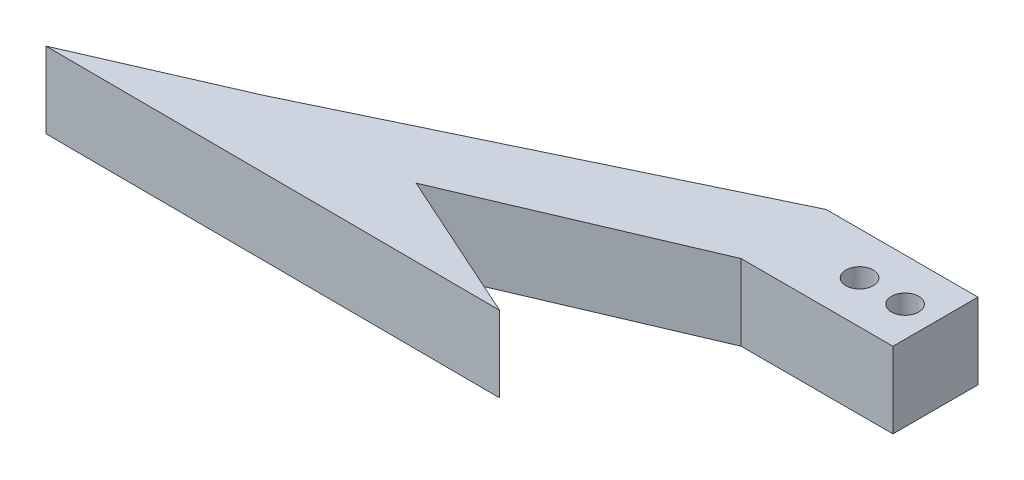
ISO-10303-21;
HEADER;
FILE_DESCRIPTION(('STEP AP214'),'2;1');
FILE_NAME('part.step','',(''),(''),'','','');
FILE_SCHEMA(('AUTOMOTIVE_DESIGN { 1 0 10303 214 1 1 1 1 }'));
ENDSEC;
DATA;
#1=APPLICATION_CONTEXT('core data for automotive mechanical design processes');
#2=APPLICATION_PROTOCOL_DEFINITION('international standard','automotive_design',2000,#1);
#3=PRODUCT_CONTEXT('',#1,'mechanical');
#4=PRODUCT('Part','Part','',(#3));
#5=PRODUCT_RELATED_PRODUCT_CATEGORY('part','',(#4));
#6=PRODUCT_DEFINITION_FORMATION('','',#4);
#7=PRODUCT_DEFINITION_CONTEXT('part definition',#1,'design');
#8=PRODUCT_DEFINITION('design','',#6,#7);
#9=PRODUCT_DEFINITION_SHAPE('','',#8);
#10=(LENGTH_UNIT() NAMED_UNIT(*) SI_UNIT(.MILLI.,.METRE.));
#11=(NAMED_UNIT(*) PLANE_ANGLE_UNIT() SI_UNIT($,.RADIAN.));
#12=(NAMED_UNIT(*) SI_UNIT($,.STERADIAN.) SOLID_ANGLE_UNIT());
#13=UNCERTAINTY_MEASURE_WITH_UNIT(LENGTH_MEASURE(1.E-05),#10,'distance_accuracy_value','');
#14=(GEOMETRIC_REPRESENTATION_CONTEXT(3) GLOBAL_UNCERTAINTY_ASSIGNED_CONTEXT((#13)) GLOBAL_UNIT_ASSIGNED_CONTEXT((#10,
#11,#12)) REPRESENTATION_CONTEXT('',''));
#15=CARTESIAN_POINT('',(0.,0.,0.));
#16=DIRECTION('',(0.,0.,1.));
#17=DIRECTION('',(1.,0.,0.));
#18=AXIS2_PLACEMENT_3D('',#15,#16,#17);
#19=CARTESIAN_POINT('',(-0.672341705519628,6.35,-1.57580087231163));
#20=DIRECTION('',(0.392438685047784,0.,0.919778168080742));
#21=DIRECTION('',(0.919778168080743,0.,-0.392438685047784));
#22=AXIS2_PLACEMENT_3D('',#19,#20,#21);
#23=PLANE('',#22);
#24=DIRECTION('',(-0.919778168080743,0.,0.392438685047784));
#25=VECTOR('',#24,1.);
#26=CARTESIAN_POINT('',(-0.672341705519628,0.,-1.57580087231163));
#27=LINE('',#26,#25);
#28=CARTESIAN_POINT('',(-12.7,0.,3.556));
#29=VERTEX_POINT('',#28);
#30=CARTESIAN_POINT('',(-31.75,0.,11.684));
#31=VERTEX_POINT('',#30);
#32=EDGE_CURVE('E138',#29,#31,#27,.T.);
#33=ORIENTED_EDGE('',*,*,#32,.F.);
#34=DIRECTION('',(0.,-1.,0.));
#35=VECTOR('',#34,1.);
#36=CARTESIAN_POINT('',(-12.7,6.35,3.556));
#37=LINE('',#36,#35);
#38=CARTESIAN_POINT('',(-12.7,6.35,3.556));
#39=VERTEX_POINT('',#38);
#40=EDGE_CURVE('E11',#39,#29,#37,.T.);
#41=ORIENTED_EDGE('',*,*,#40,.F.);
#42=DIRECTION('',(-0.919778168080743,0.,0.392438685047784));
#43=VECTOR('',#42,1.);
#44=CARTESIAN_POINT('',(-0.672341705519628,6.35,-1.57580087231163));
#45=LINE('',#44,#43);
#46=CARTESIAN_POINT('',(-31.75,6.35,11.684));
#47=VERTEX_POINT('',#46);
#48=EDGE_CURVE('E58',#39,#47,#45,.T.);
#49=ORIENTED_EDGE('',*,*,#48,.T.);
#50=DIRECTION('',(0.,-1.,0.));
#51=VECTOR('',#50,1.);
#52=CARTESIAN_POINT('',(-31.75,6.35,11.684));
#53=LINE('',#52,#51);
#54=EDGE_CURVE('E84',#47,#31,#53,.T.);
#55=ORIENTED_EDGE('',*,*,#54,.T.);
#56=EDGE_LOOP('',(#33,#41,#49,#55));
#57=FACE_BOUND('',#56,.T.);
#58=ADVANCED_FACE('F41',(#57),#23,.T.);
#59=CARTESIAN_POINT('',(0.,6.35,3.556));
#60=DIRECTION('',(0.,0.,1.));
#61=DIRECTION('',(1.,0.,0.));
#62=AXIS2_PLACEMENT_3D('',#59,#60,#61);
#63=PLANE('',#62);
#64=DIRECTION('',(-1.,0.,0.));
#65=VECTOR('',#64,1.);
#66=CARTESIAN_POINT('',(0.,0.,3.556));
#67=LINE('',#66,#65);
#68=CARTESIAN_POINT('',(0.,0.,3.556));
#69=VERTEX_POINT('',#68);
#70=EDGE_CURVE('E141',#69,#29,#67,.T.);
#71=ORIENTED_EDGE('',*,*,#70,.F.);
#72=DIRECTION('',(0.,-1.,0.));
#73=VECTOR('',#72,1.);
#74=CARTESIAN_POINT('',(0.,6.35,3.556));
#75=LINE('',#74,#73);
#76=CARTESIAN_POINT('',(0.,6.35,3.556));
#77=VERTEX_POINT('',#76);
#78=EDGE_CURVE('E50',#77,#69,#75,.T.);
#79=ORIENTED_EDGE('',*,*,#78,.F.);
#80=DIRECTION('',(-1.,0.,0.));
#81=VECTOR('',#80,1.);
#82=CARTESIAN_POINT('',(0.,6.35,3.556));
#83=LINE('',#82,#81);
#84=EDGE_CURVE('E127',#77,#39,#83,.T.);
#85=ORIENTED_EDGE('',*,*,#84,.T.);
#86=ORIENTED_EDGE('',*,*,#40,.T.);
#87=EDGE_LOOP('',(#71,#79,#85,#86));
#88=FACE_BOUND('',#87,.T.);
#89=ADVANCED_FACE('F175',(#88),#63,.T.);
#90=CARTESIAN_POINT('',(0.,6.35,0.));
#91=DIRECTION('',(1.,0.,0.));
#92=DIRECTION('',(0.,0.,-1.));
#93=AXIS2_PLACEMENT_3D('',#90,#91,#92);
#94=PLANE('',#93);
#95=DIRECTION('',(0.,0.,1.));
#96=VECTOR('',#95,1.);
#97=CARTESIAN_POINT('',(0.,0.,0.));
#98=LINE('',#97,#96);
#99=CARTESIAN_POINT('',(0.,0.,-3.556));
#100=VERTEX_POINT('',#99);
#101=EDGE_CURVE('E146',#100,#69,#98,.T.);
#102=ORIENTED_EDGE('',*,*,#101,.F.);
#103=DIRECTION('',(0.,-1.,0.));
#104=VECTOR('',#103,1.);
#105=CARTESIAN_POINT('',(0.,6.35,-3.556));
#106=LINE('',#105,#104);
#107=CARTESIAN_POINT('',(0.,6.35,-3.556));
#108=VERTEX_POINT('',#107);
#109=EDGE_CURVE('E105',#108,#100,#106,.T.);
#110=ORIENTED_EDGE('',*,*,#109,.F.);
#111=DIRECTION('',(0.,0.,1.));
#112=VECTOR('',#111,1.);
#113=CARTESIAN_POINT('',(0.,6.35,0.));
#114=LINE('',#113,#112);
#115=EDGE_CURVE('E123',#108,#77,#114,.T.);
#116=ORIENTED_EDGE('',*,*,#115,.T.);
#117=ORIENTED_EDGE('',*,*,#78,.T.);
#118=EDGE_LOOP('',(#102,#110,#116,#117));
#119=FACE_BOUND('',#118,.T.);
#120=ADVANCED_FACE('F172',(#119),#94,.T.);
#121=CARTESIAN_POINT('',(0.,6.35,-3.556));
#122=DIRECTION('',(0.,0.,-1.));
#123=DIRECTION('',(-1.,0.,0.));
#124=AXIS2_PLACEMENT_3D('',#121,#122,#123);
#125=PLANE('',#124);
#126=DIRECTION('',(1.,0.,0.));
#127=VECTOR('',#126,1.);
#128=CARTESIAN_POINT('',(0.,0.,-3.556));
#129=LINE('',#128,#127);
#130=CARTESIAN_POINT('',(-12.7,0.,-3.556));
#131=VERTEX_POINT('',#130);
#132=EDGE_CURVE('E103',#131,#100,#129,.T.);
#133=ORIENTED_EDGE('',*,*,#132,.F.);
#134=DIRECTION('',(0.,-1.,0.));
#135=VECTOR('',#134,1.);
#136=CARTESIAN_POINT('',(-12.7,6.35,-3.556));
#137=LINE('',#136,#135);
#138=CARTESIAN_POINT('',(-12.7,6.35,-3.556));
#139=VERTEX_POINT('',#138);
#140=EDGE_CURVE('E79',#139,#131,#137,.T.);
#141=ORIENTED_EDGE('',*,*,#140,.F.);
#142=DIRECTION('',(1.,0.,0.));
#143=VECTOR('',#142,1.);
#144=CARTESIAN_POINT('',(0.,6.35,-3.556));
#145=LINE('',#144,#143);
#146=EDGE_CURVE('E101',#139,#108,#145,.T.);
#147=ORIENTED_EDGE('',*,*,#146,.T.);
#148=ORIENTED_EDGE('',*,*,#109,.T.);
#149=EDGE_LOOP('',(#133,#141,#147,#148));
#150=FACE_BOUND('',#149,.T.);
#151=ADVANCED_FACE('F99',(#150),#125,.T.);
#152=CARTESIAN_POINT('',(-3.76540962288687,6.35,-7.84460338101431));
#153=DIRECTION('',(0.432731067584771,0.,0.901523057468274));
#154=DIRECTION('',(0.901523057468274,0.,-0.432731067584771));
#155=AXIS2_PLACEMENT_3D('',#152,#153,#154);
#156=PLANE('',#155);
#157=DIRECTION('',(-0.901523057468274,0.,0.432731067584771));
#158=VECTOR('',#157,1.);
#159=CARTESIAN_POINT('',(-3.76540962288687,0.,-7.84460338101431));
#160=LINE('',#159,#158);
#161=CARTESIAN_POINT('',(-44.45,0.,11.684));
#162=VERTEX_POINT('',#161);
#163=EDGE_CURVE('E152',#131,#162,#160,.T.);
#164=ORIENTED_EDGE('',*,*,#163,.T.);
#165=DIRECTION('',(0.,-1.,0.));
#166=VECTOR('',#165,1.);
#167=CARTESIAN_POINT('',(-44.45,6.35,11.684));
#168=LINE('',#167,#166);
#169=CARTESIAN_POINT('',(-44.45,6.35,11.684));
#170=VERTEX_POINT('',#169);
#171=EDGE_CURVE('E106',#170,#162,#168,.T.);
#172=ORIENTED_EDGE('',*,*,#171,.F.);
#173=DIRECTION('',(-0.901523057468274,0.,0.432731067584771));
#174=VECTOR('',#173,1.);
#175=CARTESIAN_POINT('',(-3.76540962288687,6.35,-7.84460338101431));
#176=LINE('',#175,#174);
#177=EDGE_CURVE('E109',#139,#170,#176,.T.);
#178=ORIENTED_EDGE('',*,*,#177,.F.);
#179=ORIENTED_EDGE('',*,*,#140,.T.);
#180=EDGE_LOOP('',(#164,#172,#178,#179));
#181=FACE_BOUND('',#180,.T.);
#182=ADVANCED_FACE('F110',(#181),#156,.F.);
#183=CARTESIAN_POINT('',(-6.35,6.35,0.));
#184=DIRECTION('',(0.,-1.,0.));
#185=DIRECTION('',(0.,0.,-1.));
#186=AXIS2_PLACEMENT_3D('',#183,#184,#185);
#187=CYLINDRICAL_SURFACE('',#186,1.143);
#188=CARTESIAN_POINT('',(-6.35,6.35,0.));
#189=DIRECTION('',(0.,1.,0.));
#190=DIRECTION('',(0.,0.,1.));
#191=AXIS2_PLACEMENT_3D('',#188,#189,#190);
#192=CIRCLE('',#191,1.143);
#193=CARTESIAN_POINT('',(-6.35,6.35,1.143));
#194=VERTEX_POINT('',#193);
#195=EDGE_CURVE('E116',#194,#194,#192,.T.);
#196=ORIENTED_EDGE('',*,*,#195,.T.);
#197=EDGE_LOOP('',(#196));
#198=FACE_BOUND('',#197,.T.);
#199=CARTESIAN_POINT('',(-6.35,0.,0.));
#200=DIRECTION('',(0.,1.,0.));
#201=DIRECTION('',(0.,0.,1.));
#202=AXIS2_PLACEMENT_3D('',#199,#200,#201);
#203=CIRCLE('',#202,1.143);
#204=CARTESIAN_POINT('',(-6.35,0.,1.143));
#205=VERTEX_POINT('',#204);
#206=EDGE_CURVE('E155',#205,#205,#203,.T.);
#207=ORIENTED_EDGE('',*,*,#206,.F.);
#208=EDGE_LOOP('',(#207));
#209=FACE_BOUND('',#208,.T.);
#210=ADVANCED_FACE('F252',(#198,#209),#187,.F.);
#211=CARTESIAN_POINT('',(-2.54,6.35,0.));
#212=DIRECTION('',(0.,-1.,0.));
#213=DIRECTION('',(0.,0.,-1.));
#214=AXIS2_PLACEMENT_3D('',#211,#212,#213);
#215=CYLINDRICAL_SURFACE('',#214,1.143);
#216=CARTESIAN_POINT('',(-2.54,6.35,0.));
#217=DIRECTION('',(0.,1.,0.));
#218=DIRECTION('',(0.,0.,1.));
#219=AXIS2_PLACEMENT_3D('',#216,#217,#218);
#220=CIRCLE('',#219,1.143);
#221=CARTESIAN_POINT('',(-2.54,6.35,1.143));
#222=VERTEX_POINT('',#221);
#223=EDGE_CURVE('E134',#222,#222,#220,.T.);
#224=ORIENTED_EDGE('',*,*,#223,.T.);
#225=EDGE_LOOP('',(#224));
#226=FACE_BOUND('',#225,.T.);
#227=CARTESIAN_POINT('',(-2.54,0.,0.));
#228=DIRECTION('',(0.,1.,0.));
#229=DIRECTION('',(0.,0.,1.));
#230=AXIS2_PLACEMENT_3D('',#227,#228,#229);
#231=CIRCLE('',#230,1.143);
#232=CARTESIAN_POINT('',(-2.54,0.,1.143));
#233=VERTEX_POINT('',#232);
#234=EDGE_CURVE('E159',#233,#233,#231,.T.);
#235=ORIENTED_EDGE('',*,*,#234,.F.);
#236=EDGE_LOOP('',(#235));
#237=FACE_BOUND('',#236,.T.);
#238=ADVANCED_FACE('F255',(#226,#237),#215,.F.);
#239=CARTESIAN_POINT('',(0.,6.35,0.));
#240=DIRECTION('',(0.,1.,0.));
#241=DIRECTION('',(0.,0.,1.));
#242=AXIS2_PLACEMENT_3D('',#239,#240,#241);
#243=PLANE('',#242);
#244=ORIENTED_EDGE('',*,*,#48,.F.);
#245=ORIENTED_EDGE('',*,*,#84,.F.);
#246=ORIENTED_EDGE('',*,*,#115,.F.);
#247=ORIENTED_EDGE('',*,*,#146,.F.);
#248=ORIENTED_EDGE('',*,*,#177,.T.);
#249=DIRECTION('',(-0.916386556062429,0.,0.40029449142855));
#250=VECTOR('',#249,1.);
#251=CARTESIAN_POINT('',(-44.45,6.35,11.684));
#252=LINE('',#251,#250);
#253=CARTESIAN_POINT('',(-57.15,6.35,17.2315934336997));
#254=VERTEX_POINT('',#253);
#255=EDGE_CURVE('E190',#170,#254,#252,.T.);
#256=ORIENTED_EDGE('',*,*,#255,.T.);
#257=DIRECTION('',(0.999990480720735,0.,0.00436330928474624));
#258=VECTOR('',#257,1.);
#259=CARTESIAN_POINT('',(-57.15,6.35,17.2315934336997));
#260=LINE('',#259,#258);
#261=CARTESIAN_POINT('',(-19.05,6.35,17.3978370999684));
#262=VERTEX_POINT('',#261);
#263=EDGE_CURVE('E215',#254,#262,#260,.T.);
#264=ORIENTED_EDGE('',*,*,#263,.T.);
#265=DIRECTION('',(-0.911952751696882,0.,-0.410295233548338));
#266=VECTOR('',#265,1.);
#267=CARTESIAN_POINT('',(-19.05,6.35,17.3978370999684));
#268=LINE('',#267,#266);
#269=EDGE_CURVE('E209',#262,#47,#268,.T.);
#270=ORIENTED_EDGE('',*,*,#269,.T.);
#271=EDGE_LOOP('',(#244,#245,#246,#247,#248,#256,#264,#270));
#272=FACE_BOUND('',#271,.T.);
#273=ORIENTED_EDGE('',*,*,#195,.F.);
#274=EDGE_LOOP('',(#273));
#275=FACE_BOUND('',#274,.T.);
#276=ORIENTED_EDGE('',*,*,#223,.F.);
#277=EDGE_LOOP('',(#276));
#278=FACE_BOUND('',#277,.T.);
#279=ADVANCED_FACE('F119',(#272,#275,#278),#243,.T.);
#280=CARTESIAN_POINT('',(0.,0.,0.));
#281=DIRECTION('',(0.,1.,0.));
#282=DIRECTION('',(0.,0.,1.));
#283=AXIS2_PLACEMENT_3D('',#280,#281,#282);
#284=PLANE('',#283);
#285=ORIENTED_EDGE('',*,*,#32,.T.);
#286=DIRECTION('',(-0.911952751696882,0.,-0.410295233548338));
#287=VECTOR('',#286,1.);
#288=CARTESIAN_POINT('',(-19.05,0.,17.3978370999684));
#289=LINE('',#288,#287);
#290=CARTESIAN_POINT('',(-19.05,0.,17.3978370999684));
#291=VERTEX_POINT('',#290);
#292=EDGE_CURVE('E204',#291,#31,#289,.T.);
#293=ORIENTED_EDGE('',*,*,#292,.F.);
#294=DIRECTION('',(0.999990480720735,0.,0.00436330928474624));
#295=VECTOR('',#294,1.);
#296=CARTESIAN_POINT('',(-57.15,0.,17.2315934336997));
#297=LINE('',#296,#295);
#298=CARTESIAN_POINT('',(-57.15,0.,17.2315934336997));
#299=VERTEX_POINT('',#298);
#300=EDGE_CURVE('E196',#299,#291,#297,.T.);
#301=ORIENTED_EDGE('',*,*,#300,.F.);
#302=DIRECTION('',(-0.916386556062429,0.,0.40029449142855));
#303=VECTOR('',#302,1.);
#304=CARTESIAN_POINT('',(-44.45,0.,11.684));
#305=LINE('',#304,#303);
#306=EDGE_CURVE('E183',#162,#299,#305,.T.);
#307=ORIENTED_EDGE('',*,*,#306,.F.);
#308=ORIENTED_EDGE('',*,*,#163,.F.);
#309=ORIENTED_EDGE('',*,*,#132,.T.);
#310=ORIENTED_EDGE('',*,*,#101,.T.);
#311=ORIENTED_EDGE('',*,*,#70,.T.);
#312=EDGE_LOOP('',(#285,#293,#301,#307,#308,#309,#310,#311));
#313=FACE_BOUND('',#312,.T.);
#314=ORIENTED_EDGE('',*,*,#206,.T.);
#315=EDGE_LOOP('',(#314));
#316=FACE_BOUND('',#315,.T.);
#317=ORIENTED_EDGE('',*,*,#234,.T.);
#318=EDGE_LOOP('',(#317));
#319=FACE_BOUND('',#318,.T.);
#320=ADVANCED_FACE('F177',(#313,#316,#319),#284,.F.);
#321=CARTESIAN_POINT('',(-44.45,6.35,11.684));
#322=DIRECTION('',(0.40029449142855,0.,0.916386556062429));
#323=DIRECTION('',(0.916386556062429,0.,-0.40029449142855));
#324=AXIS2_PLACEMENT_3D('',#321,#322,#323);
#325=PLANE('',#324);
#326=ORIENTED_EDGE('',*,*,#306,.T.);
#327=DIRECTION('',(0.,-1.,0.));
#328=VECTOR('',#327,1.);
#329=CARTESIAN_POINT('',(-57.15,6.35,17.2315934336997));
#330=LINE('',#329,#328);
#331=EDGE_CURVE('E142',#254,#299,#330,.T.);
#332=ORIENTED_EDGE('',*,*,#331,.F.);
#333=ORIENTED_EDGE('',*,*,#255,.F.);
#334=ORIENTED_EDGE('',*,*,#171,.T.);
#335=EDGE_LOOP('',(#326,#332,#333,#334));
#336=FACE_BOUND('',#335,.T.);
#337=ADVANCED_FACE('F229',(#336),#325,.F.);
#338=CARTESIAN_POINT('',(-57.15,6.35,17.2315934336997));
#339=DIRECTION('',(0.00436330928474624,0.,-0.999990480720734));
#340=DIRECTION('',(-0.999990480720734,0.,-0.00436330928474624));
#341=AXIS2_PLACEMENT_3D('',#338,#339,#340);
#342=PLANE('',#341);
#343=ORIENTED_EDGE('',*,*,#300,.T.);
#344=DIRECTION('',(0.,-1.,0.));
#345=VECTOR('',#344,1.);
#346=CARTESIAN_POINT('',(-19.05,6.35,17.3978370999684));
#347=LINE('',#346,#345);
#348=EDGE_CURVE('E200',#262,#291,#347,.T.);
#349=ORIENTED_EDGE('',*,*,#348,.F.);
#350=ORIENTED_EDGE('',*,*,#263,.F.);
#351=ORIENTED_EDGE('',*,*,#331,.T.);
#352=EDGE_LOOP('',(#343,#349,#350,#351));
#353=FACE_BOUND('',#352,.T.);
#354=ADVANCED_FACE('F198',(#353),#342,.F.);
#355=CARTESIAN_POINT('',(-19.05,6.35,17.3978370999684));
#356=DIRECTION('',(-0.410295233548338,0.,0.911952751696882));
#357=DIRECTION('',(0.911952751696882,0.,0.410295233548338));
#358=AXIS2_PLACEMENT_3D('',#355,#356,#357);
#359=PLANE('',#358);
#360=ORIENTED_EDGE('',*,*,#292,.T.);
#361=ORIENTED_EDGE('',*,*,#54,.F.);
#362=ORIENTED_EDGE('',*,*,#269,.F.);
#363=ORIENTED_EDGE('',*,*,#348,.T.);
#364=EDGE_LOOP('',(#360,#361,#362,#363));
#365=FACE_BOUND('',#364,.T.);
#366=ADVANCED_FACE('F208',(#365),#359,.F.);
#367=CLOSED_SHELL('',(#58,#89,#120,#151,#182,#210,#238,#279,#320,#337,#354,#366));
#368=MANIFOLD_SOLID_BREP('B2',#367);
#369=ADVANCED_BREP_SHAPE_REPRESENTATION('',(#18,#368),#14);
#370=SHAPE_DEFINITION_REPRESENTATION(#9,#369);
ENDSEC;
END-ISO-10303-21;
